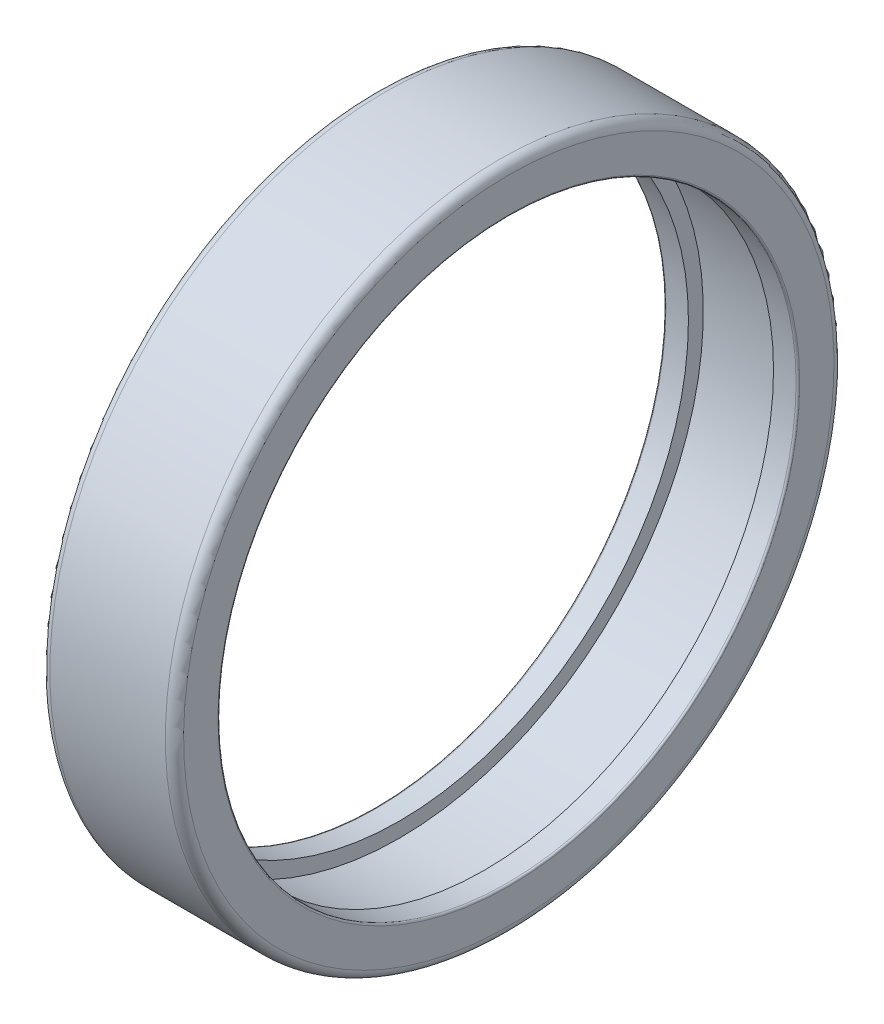
ISO-10303-21;
HEADER;
FILE_DESCRIPTION(('STEP AP214'),'2;1');
FILE_NAME('part.step','',(''),(''),'','','');
FILE_SCHEMA(('AUTOMOTIVE_DESIGN { 1 0 10303 214 1 1 1 1 }'));
ENDSEC;
DATA;
#1=APPLICATION_CONTEXT('core data for automotive mechanical design processes');
#2=APPLICATION_PROTOCOL_DEFINITION('international standard','automotive_design',2000,#1);
#3=PRODUCT_CONTEXT('',#1,'mechanical');
#4=PRODUCT('Part','Part','',(#3));
#5=PRODUCT_RELATED_PRODUCT_CATEGORY('part','',(#4));
#6=PRODUCT_DEFINITION_FORMATION('','',#4);
#7=PRODUCT_DEFINITION_CONTEXT('part definition',#1,'design');
#8=PRODUCT_DEFINITION('design','',#6,#7);
#9=PRODUCT_DEFINITION_SHAPE('','',#8);
#10=(LENGTH_UNIT() NAMED_UNIT(*) SI_UNIT(.MILLI.,.METRE.));
#11=(NAMED_UNIT(*) PLANE_ANGLE_UNIT() SI_UNIT($,.RADIAN.));
#12=(NAMED_UNIT(*) SI_UNIT($,.STERADIAN.) SOLID_ANGLE_UNIT());
#13=UNCERTAINTY_MEASURE_WITH_UNIT(LENGTH_MEASURE(1.E-05),#10,'distance_accuracy_value','');
#14=(GEOMETRIC_REPRESENTATION_CONTEXT(3) GLOBAL_UNCERTAINTY_ASSIGNED_CONTEXT((#13)) GLOBAL_UNIT_ASSIGNED_CONTEXT((#10,
#11,#12)) REPRESENTATION_CONTEXT('',''));
#15=CARTESIAN_POINT('',(0.,0.,0.));
#16=DIRECTION('',(0.,0.,1.));
#17=DIRECTION('',(1.,0.,0.));
#18=AXIS2_PLACEMENT_3D('',#15,#16,#17);
#19=CARTESIAN_POINT('',(21.7,0.,0.));
#20=DIRECTION('',(1.,0.,0.));
#21=DIRECTION('',(0.,0.,-1.));
#22=AXIS2_PLACEMENT_3D('',#19,#20,#21);
#23=TOROIDAL_SURFACE('',#22,47.85,0.3);
#24=CARTESIAN_POINT('',(22.,0.,0.));
#25=DIRECTION('',(1.,0.,0.));
#26=DIRECTION('',(0.,1.,0.));
#27=AXIS2_PLACEMENT_3D('',#24,#25,#26);
#28=CIRCLE('',#27,47.85);
#29=CARTESIAN_POINT('',(22.,47.85,0.));
#30=VERTEX_POINT('',#29);
#31=EDGE_CURVE('E11',#30,#30,#28,.T.);
#32=ORIENTED_EDGE('',*,*,#31,.T.);
#33=EDGE_LOOP('',(#32));
#34=FACE_BOUND('',#33,.T.);
#35=CARTESIAN_POINT('',(21.7,0.,0.));
#36=DIRECTION('',(1.,0.,0.));
#37=DIRECTION('',(0.,1.,0.));
#38=AXIS2_PLACEMENT_3D('',#35,#36,#37);
#39=CIRCLE('',#38,47.55);
#40=CARTESIAN_POINT('',(21.7,47.55,0.));
#41=VERTEX_POINT('',#40);
#42=EDGE_CURVE('E77',#41,#41,#39,.T.);
#43=ORIENTED_EDGE('',*,*,#42,.F.);
#44=EDGE_LOOP('',(#43));
#45=FACE_BOUND('',#44,.T.);
#46=ADVANCED_FACE('F17',(#34,#45),#23,.T.);
#47=CARTESIAN_POINT('',(22.,50.675,0.));
#48=DIRECTION('',(1.,0.,0.));
#49=DIRECTION('',(0.,1.,0.));
#50=AXIS2_PLACEMENT_3D('',#47,#48,#49);
#51=PLANE('',#50);
#52=CARTESIAN_POINT('',(22.,0.,0.));
#53=DIRECTION('',(1.,0.,0.));
#54=DIRECTION('',(0.,1.,0.));
#55=AXIS2_PLACEMENT_3D('',#52,#53,#54);
#56=CIRCLE('',#55,53.5);
#57=CARTESIAN_POINT('',(22.,53.5,0.));
#58=VERTEX_POINT('',#57);
#59=EDGE_CURVE('E27',#58,#58,#56,.T.);
#60=ORIENTED_EDGE('',*,*,#59,.T.);
#61=EDGE_LOOP('',(#60));
#62=FACE_BOUND('',#61,.T.);
#63=ORIENTED_EDGE('',*,*,#31,.F.);
#64=EDGE_LOOP('',(#63));
#65=FACE_BOUND('',#64,.T.);
#66=ADVANCED_FACE('F106',(#62,#65),#51,.T.);
#67=CARTESIAN_POINT('',(20.5,0.,0.));
#68=DIRECTION('',(1.,0.,0.));
#69=DIRECTION('',(0.,0.,-1.));
#70=AXIS2_PLACEMENT_3D('',#67,#68,#69);
#71=TOROIDAL_SURFACE('',#70,53.5,1.5);
#72=CARTESIAN_POINT('',(20.5,0.,0.));
#73=DIRECTION('',(1.,0.,0.));
#74=DIRECTION('',(0.,1.,0.));
#75=AXIS2_PLACEMENT_3D('',#72,#73,#74);
#76=CIRCLE('',#75,55.);
#77=CARTESIAN_POINT('',(20.5,55.,0.));
#78=VERTEX_POINT('',#77);
#79=EDGE_CURVE('E75',#78,#78,#76,.T.);
#80=ORIENTED_EDGE('',*,*,#79,.T.);
#81=EDGE_LOOP('',(#80));
#82=FACE_BOUND('',#81,.T.);
#83=ORIENTED_EDGE('',*,*,#59,.F.);
#84=EDGE_LOOP('',(#83));
#85=FACE_BOUND('',#84,.T.);
#86=ADVANCED_FACE('F111',(#82,#85),#71,.T.);
#87=CARTESIAN_POINT('',(11.,0.,0.));
#88=DIRECTION('',(-1.,0.,0.));
#89=DIRECTION('',(0.,1.,0.));
#90=AXIS2_PLACEMENT_3D('',#87,#88,#89);
#91=CYLINDRICAL_SURFACE('',#90,55.);
#92=CARTESIAN_POINT('',(1.5,0.,0.));
#93=DIRECTION('',(1.,0.,0.));
#94=DIRECTION('',(0.,1.,0.));
#95=AXIS2_PLACEMENT_3D('',#92,#93,#94);
#96=CIRCLE('',#95,55.);
#97=CARTESIAN_POINT('',(1.5,55.,0.));
#98=VERTEX_POINT('',#97);
#99=EDGE_CURVE('E68',#98,#98,#96,.T.);
#100=ORIENTED_EDGE('',*,*,#99,.T.);
#101=EDGE_LOOP('',(#100));
#102=FACE_BOUND('',#101,.T.);
#103=ORIENTED_EDGE('',*,*,#79,.F.);
#104=EDGE_LOOP('',(#103));
#105=FACE_BOUND('',#104,.T.);
#106=ADVANCED_FACE('F116',(#102,#105),#91,.T.);
#107=CARTESIAN_POINT('',(1.5,0.,0.));
#108=DIRECTION('',(1.,0.,0.));
#109=DIRECTION('',(0.,0.,-1.));
#110=AXIS2_PLACEMENT_3D('',#107,#108,#109);
#111=TOROIDAL_SURFACE('',#110,53.5,1.5);
#112=CARTESIAN_POINT('',(0.,0.,0.));
#113=DIRECTION('',(1.,0.,0.));
#114=DIRECTION('',(0.,1.,0.));
#115=AXIS2_PLACEMENT_3D('',#112,#113,#114);
#116=CIRCLE('',#115,53.5);
#117=CARTESIAN_POINT('',(0.,53.5,0.));
#118=VERTEX_POINT('',#117);
#119=EDGE_CURVE('E66',#118,#118,#116,.T.);
#120=ORIENTED_EDGE('',*,*,#119,.T.);
#121=EDGE_LOOP('',(#120));
#122=FACE_BOUND('',#121,.T.);
#123=ORIENTED_EDGE('',*,*,#99,.F.);
#124=EDGE_LOOP('',(#123));
#125=FACE_BOUND('',#124,.T.);
#126=ADVANCED_FACE('F130',(#122,#125),#111,.T.);
#127=CARTESIAN_POINT('',(0.,50.675,0.));
#128=DIRECTION('',(-1.,0.,0.));
#129=DIRECTION('',(0.,-1.,0.));
#130=AXIS2_PLACEMENT_3D('',#127,#128,#129);
#131=PLANE('',#130);
#132=CARTESIAN_POINT('',(0.,0.,0.));
#133=DIRECTION('',(1.,0.,0.));
#134=DIRECTION('',(0.,1.,0.));
#135=AXIS2_PLACEMENT_3D('',#132,#133,#134);
#136=CIRCLE('',#135,47.85);
#137=CARTESIAN_POINT('',(0.,47.85,0.));
#138=VERTEX_POINT('',#137);
#139=EDGE_CURVE('E62',#138,#138,#136,.T.);
#140=ORIENTED_EDGE('',*,*,#139,.T.);
#141=EDGE_LOOP('',(#140));
#142=FACE_BOUND('',#141,.T.);
#143=ORIENTED_EDGE('',*,*,#119,.F.);
#144=EDGE_LOOP('',(#143));
#145=FACE_BOUND('',#144,.T.);
#146=ADVANCED_FACE('F63',(#142,#145),#131,.T.);
#147=CARTESIAN_POINT('',(0.3,0.,0.));
#148=DIRECTION('',(1.,0.,0.));
#149=DIRECTION('',(0.,0.,-1.));
#150=AXIS2_PLACEMENT_3D('',#147,#148,#149);
#151=TOROIDAL_SURFACE('',#150,47.85,0.3);
#152=CARTESIAN_POINT('',(0.3,0.,0.));
#153=DIRECTION('',(1.,0.,0.));
#154=DIRECTION('',(0.,1.,0.));
#155=AXIS2_PLACEMENT_3D('',#152,#153,#154);
#156=CIRCLE('',#155,47.55);
#157=CARTESIAN_POINT('',(0.3,47.55,0.));
#158=VERTEX_POINT('',#157);
#159=EDGE_CURVE('E21',#158,#158,#156,.T.);
#160=ORIENTED_EDGE('',*,*,#159,.T.);
#161=EDGE_LOOP('',(#160));
#162=FACE_BOUND('',#161,.T.);
#163=ORIENTED_EDGE('',*,*,#139,.F.);
#164=EDGE_LOOP('',(#163));
#165=FACE_BOUND('',#164,.T.);
#166=ADVANCED_FACE('F121',(#162,#165),#151,.T.);
#167=CARTESIAN_POINT('',(2.15,0.,0.));
#168=DIRECTION('',(-1.,0.,0.));
#169=DIRECTION('',(0.,1.,0.));
#170=AXIS2_PLACEMENT_3D('',#167,#168,#169);
#171=CYLINDRICAL_SURFACE('',#170,47.55);
#172=CARTESIAN_POINT('',(4.,0.,0.));
#173=DIRECTION('',(1.,0.,0.));
#174=DIRECTION('',(0.,1.,0.));
#175=AXIS2_PLACEMENT_3D('',#172,#173,#174);
#176=CIRCLE('',#175,47.55);
#177=CARTESIAN_POINT('',(4.,47.55,0.));
#178=VERTEX_POINT('',#177);
#179=EDGE_CURVE('E70',#178,#178,#176,.T.);
#180=ORIENTED_EDGE('',*,*,#179,.T.);
#181=EDGE_LOOP('',(#180));
#182=FACE_BOUND('',#181,.T.);
#183=ORIENTED_EDGE('',*,*,#159,.F.);
#184=EDGE_LOOP('',(#183));
#185=FACE_BOUND('',#184,.T.);
#186=ADVANCED_FACE('F103',(#182,#185),#171,.F.);
#187=CARTESIAN_POINT('',(4.,48.775,0.));
#188=DIRECTION('',(1.,0.,0.));
#189=DIRECTION('',(0.,1.,0.));
#190=AXIS2_PLACEMENT_3D('',#187,#188,#189);
#191=PLANE('',#190);
#192=CARTESIAN_POINT('',(4.,0.,0.));
#193=DIRECTION('',(1.,0.,0.));
#194=DIRECTION('',(0.,1.,0.));
#195=AXIS2_PLACEMENT_3D('',#192,#193,#194);
#196=CIRCLE('',#195,50.);
#197=CARTESIAN_POINT('',(4.,50.,0.));
#198=VERTEX_POINT('',#197);
#199=EDGE_CURVE('E72',#198,#198,#196,.T.);
#200=ORIENTED_EDGE('',*,*,#199,.T.);
#201=EDGE_LOOP('',(#200));
#202=FACE_BOUND('',#201,.T.);
#203=ORIENTED_EDGE('',*,*,#179,.F.);
#204=EDGE_LOOP('',(#203));
#205=FACE_BOUND('',#204,.T.);
#206=ADVANCED_FACE('F89',(#202,#205),#191,.T.);
#207=CARTESIAN_POINT('',(11.,0.,0.));
#208=DIRECTION('',(-1.,0.,0.));
#209=DIRECTION('',(0.,1.,0.));
#210=AXIS2_PLACEMENT_3D('',#207,#208,#209);
#211=CYLINDRICAL_SURFACE('',#210,50.);
#212=CARTESIAN_POINT('',(18.,0.,0.));
#213=DIRECTION('',(1.,0.,0.));
#214=DIRECTION('',(0.,1.,0.));
#215=AXIS2_PLACEMENT_3D('',#212,#213,#214);
#216=CIRCLE('',#215,50.);
#217=CARTESIAN_POINT('',(18.,50.,0.));
#218=VERTEX_POINT('',#217);
#219=EDGE_CURVE('E79',#218,#218,#216,.T.);
#220=ORIENTED_EDGE('',*,*,#219,.T.);
#221=EDGE_LOOP('',(#220));
#222=FACE_BOUND('',#221,.T.);
#223=ORIENTED_EDGE('',*,*,#199,.F.);
#224=EDGE_LOOP('',(#223));
#225=FACE_BOUND('',#224,.T.);
#226=ADVANCED_FACE('F19',(#222,#225),#211,.F.);
#227=CARTESIAN_POINT('',(18.,48.775,0.));
#228=DIRECTION('',(-1.,0.,0.));
#229=DIRECTION('',(0.,-1.,0.));
#230=AXIS2_PLACEMENT_3D('',#227,#228,#229);
#231=PLANE('',#230);
#232=CARTESIAN_POINT('',(18.,0.,0.));
#233=DIRECTION('',(1.,0.,0.));
#234=DIRECTION('',(0.,1.,0.));
#235=AXIS2_PLACEMENT_3D('',#232,#233,#234);
#236=CIRCLE('',#235,47.55);
#237=CARTESIAN_POINT('',(18.,47.55,0.));
#238=VERTEX_POINT('',#237);
#239=EDGE_CURVE('E80',#238,#238,#236,.T.);
#240=ORIENTED_EDGE('',*,*,#239,.T.);
#241=EDGE_LOOP('',(#240));
#242=FACE_BOUND('',#241,.T.);
#243=ORIENTED_EDGE('',*,*,#219,.F.);
#244=EDGE_LOOP('',(#243));
#245=FACE_BOUND('',#244,.T.);
#246=ADVANCED_FACE('F93',(#242,#245),#231,.T.);
#247=CARTESIAN_POINT('',(19.85,0.,0.));
#248=DIRECTION('',(-1.,0.,0.));
#249=DIRECTION('',(0.,1.,0.));
#250=AXIS2_PLACEMENT_3D('',#247,#248,#249);
#251=CYLINDRICAL_SURFACE('',#250,47.55);
#252=ORIENTED_EDGE('',*,*,#42,.T.);
#253=EDGE_LOOP('',(#252));
#254=FACE_BOUND('',#253,.T.);
#255=ORIENTED_EDGE('',*,*,#239,.F.);
#256=EDGE_LOOP('',(#255));
#257=FACE_BOUND('',#256,.T.);
#258=ADVANCED_FACE('F100',(#254,#257),#251,.F.);
#259=CLOSED_SHELL('',(#46,#66,#86,#106,#126,#146,#166,#186,#206,#226,#246,#258));
#260=MANIFOLD_SOLID_BREP('B1',#259);
#261=ADVANCED_BREP_SHAPE_REPRESENTATION('',(#18,#260),#14);
#262=SHAPE_DEFINITION_REPRESENTATION(#9,#261);
ENDSEC;
END-ISO-10303-21;
